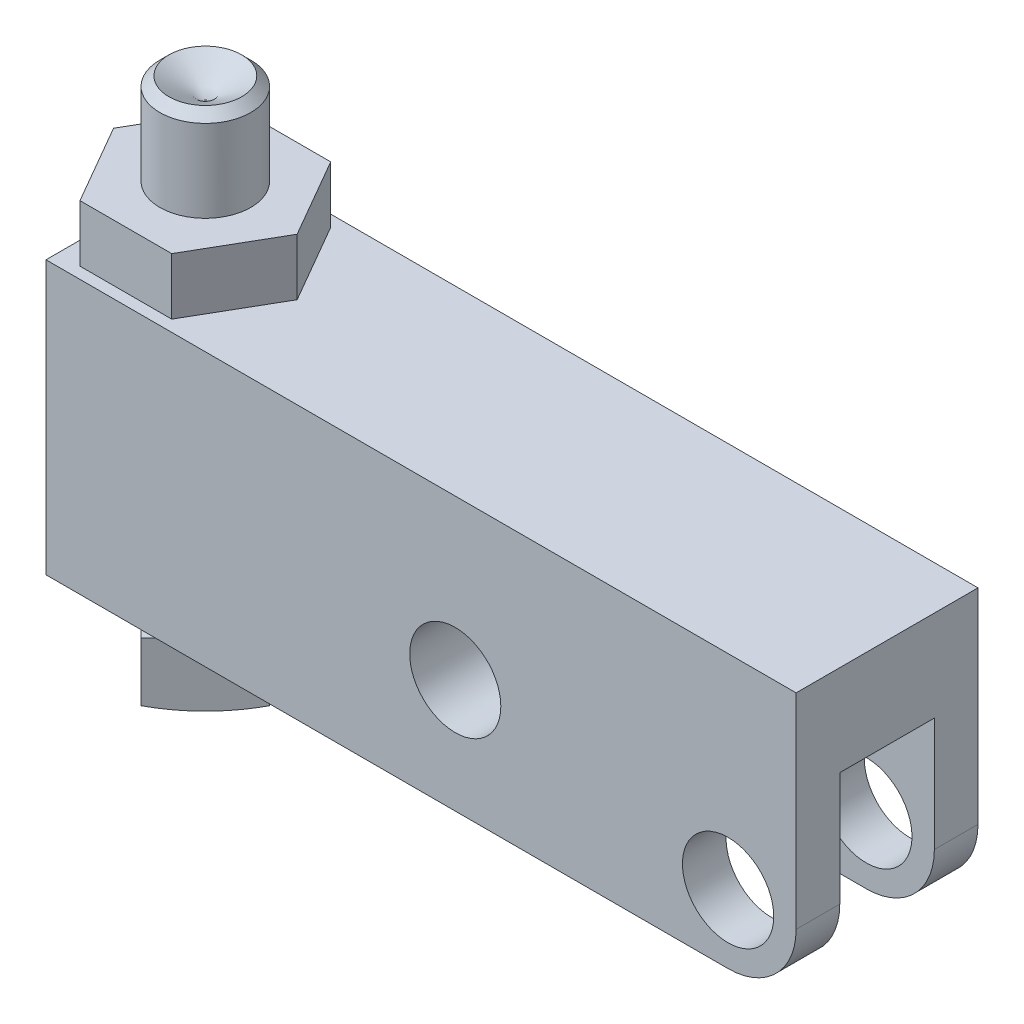
ISO-10303-21;
HEADER;
FILE_DESCRIPTION(('STEP AP214'),'2;1');
FILE_NAME('part.step','',(''),(''),'','','');
FILE_SCHEMA(('AUTOMOTIVE_DESIGN { 1 0 10303 214 1 1 1 1 }'));
ENDSEC;
DATA;
#1=APPLICATION_CONTEXT('core data for automotive mechanical design processes');
#2=APPLICATION_PROTOCOL_DEFINITION('international standard','automotive_design',2000,#1);
#3=PRODUCT_CONTEXT('',#1,'mechanical');
#4=PRODUCT('Part','Part','',(#3));
#5=PRODUCT_RELATED_PRODUCT_CATEGORY('part','',(#4));
#6=PRODUCT_DEFINITION_FORMATION('','',#4);
#7=PRODUCT_DEFINITION_CONTEXT('part definition',#1,'design');
#8=PRODUCT_DEFINITION('design','',#6,#7);
#9=PRODUCT_DEFINITION_SHAPE('','',#8);
#10=(LENGTH_UNIT() NAMED_UNIT(*) SI_UNIT(.MILLI.,.METRE.));
#11=(NAMED_UNIT(*) PLANE_ANGLE_UNIT() SI_UNIT($,.RADIAN.));
#12=(NAMED_UNIT(*) SI_UNIT($,.STERADIAN.) SOLID_ANGLE_UNIT());
#13=UNCERTAINTY_MEASURE_WITH_UNIT(LENGTH_MEASURE(1.E-05),#10,'distance_accuracy_value','');
#14=(GEOMETRIC_REPRESENTATION_CONTEXT(3) GLOBAL_UNCERTAINTY_ASSIGNED_CONTEXT((#13)) GLOBAL_UNIT_ASSIGNED_CONTEXT((#10,
#11,#12)) REPRESENTATION_CONTEXT('',''));
#15=CARTESIAN_POINT('',(0.,0.,0.));
#16=DIRECTION('',(0.,0.,1.));
#17=DIRECTION('',(1.,0.,0.));
#18=AXIS2_PLACEMENT_3D('',#15,#16,#17);
#19=CARTESIAN_POINT('',(-46.0248,-7.112,0.));
#20=DIRECTION('',(0.,1.,0.));
#21=DIRECTION('',(-1.,0.,0.));
#22=AXIS2_PLACEMENT_3D('',#19,#20,#21);
#23=PLANE('',#22);
#24=DIRECTION('',(0.707106781186547,0.,0.707106781186548));
#25=VECTOR('',#24,1.);
#26=CARTESIAN_POINT('',(-47.3399280605346,-7.112,0.));
#27=LINE('',#26,#25);
#28=CARTESIAN_POINT('',(-45.0948640302673,-7.112,2.24506403026729));
#29=VERTEX_POINT('',#28);
#30=CARTESIAN_POINT('',(-42.8498,-7.112,4.49012806053458));
#31=VERTEX_POINT('',#30);
#32=EDGE_CURVE('E198',#29,#31,#27,.T.);
#33=ORIENTED_EDGE('',*,*,#32,.T.);
#34=DIRECTION('',(0.707106781186547,0.,-0.707106781186548));
#35=VECTOR('',#34,1.);
#36=CARTESIAN_POINT('',(-42.8498,-7.112,4.49012806053458));
#37=LINE('',#36,#35);
#38=CARTESIAN_POINT('',(-40.6047359697327,-7.112,2.24506403026729));
#39=VERTEX_POINT('',#38);
#40=EDGE_CURVE('E207',#31,#39,#37,.T.);
#41=ORIENTED_EDGE('',*,*,#40,.T.);
#42=CARTESIAN_POINT('',(-42.8498,-7.112,0.));
#43=DIRECTION('',(0.,1.,0.));
#44=DIRECTION('',(-1.,0.,0.));
#45=AXIS2_PLACEMENT_3D('',#42,#43,#44);
#46=CIRCLE('',#45,3.175);
#47=EDGE_CURVE('E216',#29,#39,#46,.T.);
#48=ORIENTED_EDGE('',*,*,#47,.F.);
#49=EDGE_LOOP('',(#33,#41,#48));
#50=FACE_BOUND('',#49,.T.);
#51=ADVANCED_FACE('F37',(#50),#23,.T.);
#52=CARTESIAN_POINT('',(-40.6047359697327,-7.112,-2.24506403026729));
#53=VERTEX_POINT('',#52);
#54=EDGE_CURVE('E230',#39,#53,#46,.T.);
#55=ORIENTED_EDGE('',*,*,#54,.F.);
#56=CARTESIAN_POINT('',(-38.3596719394654,-7.112,0.));
#57=VERTEX_POINT('',#56);
#58=EDGE_CURVE('E210',#39,#57,#37,.T.);
#59=ORIENTED_EDGE('',*,*,#58,.T.);
#60=DIRECTION('',(-0.707106781186547,0.,-0.707106781186548));
#61=VECTOR('',#60,1.);
#62=CARTESIAN_POINT('',(-38.3596719394654,-7.112,0.));
#63=LINE('',#62,#61);
#64=EDGE_CURVE('E400',#57,#53,#63,.T.);
#65=ORIENTED_EDGE('',*,*,#64,.T.);
#66=EDGE_LOOP('',(#55,#59,#65));
#67=FACE_BOUND('',#66,.T.);
#68=ADVANCED_FACE('F405',(#67),#23,.T.);
#69=CARTESIAN_POINT('',(-45.0948640302673,-7.112,-2.24506403026729));
#70=VERTEX_POINT('',#69);
#71=EDGE_CURVE('E409',#53,#70,#46,.T.);
#72=ORIENTED_EDGE('',*,*,#71,.F.);
#73=CARTESIAN_POINT('',(-42.8498,-7.112,-4.49012806053457));
#74=VERTEX_POINT('',#73);
#75=EDGE_CURVE('E402',#53,#74,#63,.T.);
#76=ORIENTED_EDGE('',*,*,#75,.T.);
#77=DIRECTION('',(-0.707106781186547,0.,0.707106781186548));
#78=VECTOR('',#77,1.);
#79=CARTESIAN_POINT('',(-42.8498,-7.112,-4.49012806053457));
#80=LINE('',#79,#78);
#81=EDGE_CURVE('E217',#74,#70,#80,.T.);
#82=ORIENTED_EDGE('',*,*,#81,.T.);
#83=EDGE_LOOP('',(#72,#76,#82));
#84=FACE_BOUND('',#83,.T.);
#85=ADVANCED_FACE('F419',(#84),#23,.T.);
#86=CARTESIAN_POINT('',(-47.3399280605346,-7.112,0.));
#87=VERTEX_POINT('',#86);
#88=EDGE_CURVE('E220',#70,#87,#80,.T.);
#89=ORIENTED_EDGE('',*,*,#88,.T.);
#90=EDGE_CURVE('E52',#87,#29,#27,.T.);
#91=ORIENTED_EDGE('',*,*,#90,.T.);
#92=EDGE_CURVE('E224',#70,#29,#46,.T.);
#93=ORIENTED_EDGE('',*,*,#92,.F.);
#94=EDGE_LOOP('',(#89,#91,#93));
#95=FACE_BOUND('',#94,.T.);
#96=ADVANCED_FACE('F416',(#95),#23,.T.);
#97=CARTESIAN_POINT('',(-47.625,14.3002,6.35));
#98=DIRECTION('',(0.,-1.,0.));
#99=DIRECTION('',(0.,0.,-1.));
#100=AXIS2_PLACEMENT_3D('',#97,#98,#99);
#101=PLANE('',#100);
#102=DIRECTION('',(0.5,0.,0.866025403784439));
#103=VECTOR('',#102,1.);
#104=CARTESIAN_POINT('',(-49.258272517951,14.3002,0.));
#105=LINE('',#104,#103);
#106=CARTESIAN_POINT('',(-47.625,14.3002,2.82891098369708));
#107=VERTEX_POINT('',#106);
#108=CARTESIAN_POINT('',(-46.0540362589755,14.3002,5.5499));
#109=VERTEX_POINT('',#108);
#110=EDGE_CURVE('E270',#107,#109,#105,.T.);
#111=ORIENTED_EDGE('',*,*,#110,.F.);
#112=DIRECTION('',(0.,0.,-1.));
#113=VECTOR('',#112,1.);
#114=CARTESIAN_POINT('',(-47.625,14.3002,6.35));
#115=LINE('',#114,#113);
#116=CARTESIAN_POINT('',(-47.625,14.3002,6.35));
#117=VERTEX_POINT('',#116);
#118=EDGE_CURVE('E355',#117,#107,#115,.T.);
#119=ORIENTED_EDGE('',*,*,#118,.F.);
#120=DIRECTION('',(-1.,0.,0.));
#121=VECTOR('',#120,1.);
#122=CARTESIAN_POINT('',(-47.625,14.3002,6.35));
#123=LINE('',#122,#121);
#124=CARTESIAN_POINT('',(4.7498,14.3002,6.35));
#125=VERTEX_POINT('',#124);
#126=EDGE_CURVE('E343',#125,#117,#123,.T.);
#127=ORIENTED_EDGE('',*,*,#126,.F.);
#128=DIRECTION('',(0.,0.,-1.));
#129=VECTOR('',#128,1.);
#130=CARTESIAN_POINT('',(4.7498,14.3002,6.35));
#131=LINE('',#130,#129);
#132=CARTESIAN_POINT('',(4.7498,14.3002,-6.35));
#133=VERTEX_POINT('',#132);
#134=EDGE_CURVE('E358',#125,#133,#131,.T.);
#135=ORIENTED_EDGE('',*,*,#134,.T.);
#136=DIRECTION('',(-1.,0.,0.));
#137=VECTOR('',#136,1.);
#138=CARTESIAN_POINT('',(-47.625,14.3002,-6.35));
#139=LINE('',#138,#137);
#140=CARTESIAN_POINT('',(-47.625,14.3002,-6.35));
#141=VERTEX_POINT('',#140);
#142=EDGE_CURVE('E338',#133,#141,#139,.T.);
#143=ORIENTED_EDGE('',*,*,#142,.T.);
#144=CARTESIAN_POINT('',(-47.625,14.3002,-2.82891098369709));
#145=VERTEX_POINT('',#144);
#146=EDGE_CURVE('E345',#145,#141,#115,.T.);
#147=ORIENTED_EDGE('',*,*,#146,.F.);
#148=DIRECTION('',(-0.5,0.,0.866025403784439));
#149=VECTOR('',#148,1.);
#150=CARTESIAN_POINT('',(-46.0540362589755,14.3002,-5.5499));
#151=LINE('',#150,#149);
#152=CARTESIAN_POINT('',(-46.0540362589755,14.3002,-5.5499));
#153=VERTEX_POINT('',#152);
#154=EDGE_CURVE('E264',#153,#145,#151,.T.);
#155=ORIENTED_EDGE('',*,*,#154,.F.);
#156=DIRECTION('',(-1.,0.,0.));
#157=VECTOR('',#156,1.);
#158=CARTESIAN_POINT('',(-39.6455637410245,14.3002,-5.5499));
#159=LINE('',#158,#157);
#160=CARTESIAN_POINT('',(-39.6455637410245,14.3002,-5.5499));
#161=VERTEX_POINT('',#160);
#162=EDGE_CURVE('E260',#161,#153,#159,.T.);
#163=ORIENTED_EDGE('',*,*,#162,.F.);
#164=DIRECTION('',(-0.5,0.,-0.866025403784439));
#165=VECTOR('',#164,1.);
#166=CARTESIAN_POINT('',(-36.441327482049,14.3002,0.));
#167=LINE('',#166,#165);
#168=CARTESIAN_POINT('',(-36.441327482049,14.3002,0.));
#169=VERTEX_POINT('',#168);
#170=EDGE_CURVE('E257',#169,#161,#167,.T.);
#171=ORIENTED_EDGE('',*,*,#170,.F.);
#172=DIRECTION('',(0.5,0.,-0.866025403784438));
#173=VECTOR('',#172,1.);
#174=CARTESIAN_POINT('',(-39.6455637410245,14.3002,5.5499));
#175=LINE('',#174,#173);
#176=CARTESIAN_POINT('',(-39.6455637410245,14.3002,5.5499));
#177=VERTEX_POINT('',#176);
#178=EDGE_CURVE('E239',#177,#169,#175,.T.);
#179=ORIENTED_EDGE('',*,*,#178,.F.);
#180=DIRECTION('',(1.,0.,0.));
#181=VECTOR('',#180,1.);
#182=CARTESIAN_POINT('',(-46.0540362589755,14.3002,5.5499));
#183=LINE('',#182,#181);
#184=EDGE_CURVE('E244',#109,#177,#183,.T.);
#185=ORIENTED_EDGE('',*,*,#184,.F.);
#186=EDGE_LOOP('',(#111,#119,#127,#135,#143,#147,#155,#163,#171,#179,#185));
#187=FACE_BOUND('',#186,.T.);
#188=ADVANCED_FACE('F426',(#187),#101,.F.);
#189=CARTESIAN_POINT('',(0.,0.,6.35));
#190=DIRECTION('',(0.,0.,-1.));
#191=DIRECTION('',(-1.,0.,0.));
#192=AXIS2_PLACEMENT_3D('',#189,#190,#191);
#193=CYLINDRICAL_SURFACE('',#192,3.1877);
#194=CARTESIAN_POINT('',(0.,0.,3.302));
#195=DIRECTION('',(0.,0.,1.));
#196=DIRECTION('',(1.,0.,0.));
#197=AXIS2_PLACEMENT_3D('',#194,#195,#196);
#198=CIRCLE('',#197,3.1877);
#199=CARTESIAN_POINT('',(3.1877,0.,3.302));
#200=VERTEX_POINT('',#199);
#201=EDGE_CURVE('E327',#200,#200,#198,.T.);
#202=ORIENTED_EDGE('',*,*,#201,.F.);
#203=EDGE_LOOP('',(#202));
#204=FACE_BOUND('',#203,.T.);
#205=CARTESIAN_POINT('',(0.,0.,6.35));
#206=DIRECTION('',(0.,0.,1.));
#207=DIRECTION('',(1.,0.,0.));
#208=AXIS2_PLACEMENT_3D('',#205,#206,#207);
#209=CIRCLE('',#208,3.1877);
#210=CARTESIAN_POINT('',(3.1877,0.,6.35));
#211=VERTEX_POINT('',#210);
#212=EDGE_CURVE('E328',#211,#211,#209,.T.);
#213=ORIENTED_EDGE('',*,*,#212,.T.);
#214=EDGE_LOOP('',(#213));
#215=FACE_BOUND('',#214,.T.);
#216=ADVANCED_FACE('F451',(#204,#215),#193,.F.);
#217=CARTESIAN_POINT('',(-47.625,-4.7498,6.35));
#218=DIRECTION('',(0.,0.,1.));
#219=DIRECTION('',(1.,0.,0.));
#220=AXIS2_PLACEMENT_3D('',#217,#218,#219);
#221=PLANE('',#220);
#222=ORIENTED_EDGE('',*,*,#212,.F.);
#223=EDGE_LOOP('',(#222));
#224=FACE_BOUND('',#223,.T.);
#225=DIRECTION('',(1.,0.,0.));
#226=VECTOR('',#225,1.);
#227=CARTESIAN_POINT('',(-47.625,-4.7498,6.35));
#228=LINE('',#227,#226);
#229=CARTESIAN_POINT('',(-47.625,-4.7498,6.35));
#230=VERTEX_POINT('',#229);
#231=CARTESIAN_POINT('',(0.,-4.7498,6.35));
#232=VERTEX_POINT('',#231);
#233=EDGE_CURVE('E337',#230,#232,#228,.T.);
#234=ORIENTED_EDGE('',*,*,#233,.T.);
#235=CARTESIAN_POINT('',(0.,0.,6.35));
#236=DIRECTION('',(0.,0.,1.));
#237=DIRECTION('',(1.,0.,0.));
#238=AXIS2_PLACEMENT_3D('',#235,#236,#237);
#239=CIRCLE('',#238,4.7498);
#240=CARTESIAN_POINT('',(4.7498,0.,6.35));
#241=VERTEX_POINT('',#240);
#242=EDGE_CURVE('E385',#232,#241,#239,.T.);
#243=ORIENTED_EDGE('',*,*,#242,.T.);
#244=DIRECTION('',(0.,1.,0.));
#245=VECTOR('',#244,1.);
#246=CARTESIAN_POINT('',(4.7498,14.3002,6.35));
#247=LINE('',#246,#245);
#248=EDGE_CURVE('E341',#241,#125,#247,.T.);
#249=ORIENTED_EDGE('',*,*,#248,.T.);
#250=ORIENTED_EDGE('',*,*,#126,.T.);
#251=DIRECTION('',(0.,-1.,0.));
#252=VECTOR('',#251,1.);
#253=CARTESIAN_POINT('',(-47.625,14.3002,6.35));
#254=LINE('',#253,#252);
#255=EDGE_CURVE('E334',#117,#230,#254,.T.);
#256=ORIENTED_EDGE('',*,*,#255,.T.);
#257=EDGE_LOOP('',(#234,#243,#249,#250,#256));
#258=FACE_BOUND('',#257,.T.);
#259=CARTESIAN_POINT('',(-19.05,3.175,6.35));
#260=DIRECTION('',(0.,0.,1.));
#261=DIRECTION('',(1.,0.,0.));
#262=AXIS2_PLACEMENT_3D('',#259,#260,#261);
#263=CIRCLE('',#262,3.18135);
#264=CARTESIAN_POINT('',(-15.86865,3.175,6.35));
#265=VERTEX_POINT('',#264);
#266=EDGE_CURVE('E320',#265,#265,#263,.T.);
#267=ORIENTED_EDGE('',*,*,#266,.F.);
#268=EDGE_LOOP('',(#267));
#269=FACE_BOUND('',#268,.T.);
#270=ADVANCED_FACE('F462',(#224,#258,#269),#221,.T.);
#271=CARTESIAN_POINT('',(-47.625,-4.7498,-6.35));
#272=DIRECTION('',(0.,0.,1.));
#273=DIRECTION('',(1.,0.,0.));
#274=AXIS2_PLACEMENT_3D('',#271,#272,#273);
#275=PLANE('',#274);
#276=CARTESIAN_POINT('',(0.,0.,-6.35));
#277=DIRECTION('',(0.,0.,1.));
#278=DIRECTION('',(1.,0.,0.));
#279=AXIS2_PLACEMENT_3D('',#276,#277,#278);
#280=CIRCLE('',#279,3.1877);
#281=CARTESIAN_POINT('',(3.1877,0.,-6.35));
#282=VERTEX_POINT('',#281);
#283=EDGE_CURVE('E323',#282,#282,#280,.T.);
#284=ORIENTED_EDGE('',*,*,#283,.T.);
#285=EDGE_LOOP('',(#284));
#286=FACE_BOUND('',#285,.T.);
#287=DIRECTION('',(0.,1.,0.));
#288=VECTOR('',#287,1.);
#289=CARTESIAN_POINT('',(4.7498,14.3002,-6.35));
#290=LINE('',#289,#288);
#291=CARTESIAN_POINT('',(4.7498,0.,-6.35));
#292=VERTEX_POINT('',#291);
#293=EDGE_CURVE('E351',#292,#133,#290,.T.);
#294=ORIENTED_EDGE('',*,*,#293,.F.);
#295=CARTESIAN_POINT('',(0.,0.,-6.35));
#296=DIRECTION('',(0.,0.,1.));
#297=DIRECTION('',(1.,0.,0.));
#298=AXIS2_PLACEMENT_3D('',#295,#296,#297);
#299=CIRCLE('',#298,4.7498);
#300=CARTESIAN_POINT('',(0.,-4.7498,-6.35));
#301=VERTEX_POINT('',#300);
#302=EDGE_CURVE('E375',#292,#301,#299,.F.);
#303=ORIENTED_EDGE('',*,*,#302,.T.);
#304=DIRECTION('',(1.,0.,0.));
#305=VECTOR('',#304,1.);
#306=CARTESIAN_POINT('',(-47.625,-4.7498,-6.35));
#307=LINE('',#306,#305);
#308=CARTESIAN_POINT('',(-47.625,-4.7498,-6.35));
#309=VERTEX_POINT('',#308);
#310=EDGE_CURVE('E348',#309,#301,#307,.T.);
#311=ORIENTED_EDGE('',*,*,#310,.F.);
#312=DIRECTION('',(0.,-1.,0.));
#313=VECTOR('',#312,1.);
#314=CARTESIAN_POINT('',(-47.625,14.3002,-6.35));
#315=LINE('',#314,#313);
#316=EDGE_CURVE('E331',#141,#309,#315,.T.);
#317=ORIENTED_EDGE('',*,*,#316,.F.);
#318=ORIENTED_EDGE('',*,*,#142,.F.);
#319=EDGE_LOOP('',(#294,#303,#311,#317,#318));
#320=FACE_BOUND('',#319,.T.);
#321=CARTESIAN_POINT('',(-19.05,3.175,-6.35));
#322=DIRECTION('',(0.,0.,1.));
#323=DIRECTION('',(1.,0.,0.));
#324=AXIS2_PLACEMENT_3D('',#321,#322,#323);
#325=CIRCLE('',#324,3.18135);
#326=CARTESIAN_POINT('',(-15.86865,3.175,-6.35));
#327=VERTEX_POINT('',#326);
#328=EDGE_CURVE('E324',#327,#327,#325,.T.);
#329=ORIENTED_EDGE('',*,*,#328,.T.);
#330=EDGE_LOOP('',(#329));
#331=FACE_BOUND('',#330,.T.);
#332=ADVANCED_FACE('F474',(#286,#320,#331),#275,.F.);
#333=CARTESIAN_POINT('',(-47.625,14.3002,6.35));
#334=DIRECTION('',(1.,0.,0.));
#335=DIRECTION('',(0.,1.,0.));
#336=AXIS2_PLACEMENT_3D('',#333,#334,#335);
#337=PLANE('',#336);
#338=ORIENTED_EDGE('',*,*,#316,.T.);
#339=DIRECTION('',(0.,0.,-1.));
#340=VECTOR('',#339,1.);
#341=CARTESIAN_POINT('',(-47.625,-4.7498,6.35));
#342=LINE('',#341,#340);
#343=EDGE_CURVE('E362',#230,#309,#342,.T.);
#344=ORIENTED_EDGE('',*,*,#343,.F.);
#345=ORIENTED_EDGE('',*,*,#255,.F.);
#346=ORIENTED_EDGE('',*,*,#118,.T.);
#347=EDGE_CURVE('E359',#107,#145,#115,.T.);
#348=ORIENTED_EDGE('',*,*,#347,.T.);
#349=ORIENTED_EDGE('',*,*,#146,.T.);
#350=EDGE_LOOP('',(#338,#344,#345,#346,#348,#349));
#351=FACE_BOUND('',#350,.T.);
#352=ADVANCED_FACE('F484',(#351),#337,.F.);
#353=CARTESIAN_POINT('',(-47.625,-4.7498,6.35));
#354=DIRECTION('',(0.,1.,0.));
#355=DIRECTION('',(0.,0.,1.));
#356=AXIS2_PLACEMENT_3D('',#353,#354,#355);
#357=PLANE('',#356);
#358=CARTESIAN_POINT('',(-42.8498,-4.7498,0.));
#359=DIRECTION('',(0.,1.,0.));
#360=DIRECTION('',(0.,0.,1.));
#361=AXIS2_PLACEMENT_3D('',#358,#359,#360);
#362=CIRCLE('',#361,3.175);
#363=CARTESIAN_POINT('',(-42.8498,-4.7498,3.175));
#364=VERTEX_POINT('',#363);
#365=EDGE_CURVE('E236',#364,#364,#362,.T.);
#366=ORIENTED_EDGE('',*,*,#365,.T.);
#367=EDGE_LOOP('',(#366));
#368=FACE_BOUND('',#367,.T.);
#369=ORIENTED_EDGE('',*,*,#310,.T.);
#370=DIRECTION('',(0.,0.,-1.));
#371=VECTOR('',#370,1.);
#372=CARTESIAN_POINT('',(0.,-4.7498,6.35));
#373=LINE('',#372,#371);
#374=CARTESIAN_POINT('',(0.,-4.7498,-3.302));
#375=VERTEX_POINT('',#374);
#376=EDGE_CURVE('E379',#301,#375,#373,.F.);
#377=ORIENTED_EDGE('',*,*,#376,.T.);
#378=DIRECTION('',(1.,0.,0.));
#379=VECTOR('',#378,1.);
#380=CARTESIAN_POINT('',(-7.9502,-4.7498,-3.302));
#381=LINE('',#380,#379);
#382=CARTESIAN_POINT('',(-7.9502,-4.7498,-3.302));
#383=VERTEX_POINT('',#382);
#384=EDGE_CURVE('E305',#383,#375,#381,.T.);
#385=ORIENTED_EDGE('',*,*,#384,.F.);
#386=CARTESIAN_POINT('',(-7.9502,-4.7498,0.));
#387=DIRECTION('',(0.,-1.,0.));
#388=DIRECTION('',(0.,0.,-1.));
#389=AXIS2_PLACEMENT_3D('',#386,#387,#388);
#390=CIRCLE('',#389,3.302);
#391=CARTESIAN_POINT('',(-7.9502,-4.7498,3.302));
#392=VERTEX_POINT('',#391);
#393=EDGE_CURVE('E290',#392,#383,#390,.T.);
#394=ORIENTED_EDGE('',*,*,#393,.F.);
#395=DIRECTION('',(-1.,0.,0.));
#396=VECTOR('',#395,1.);
#397=CARTESIAN_POINT('',(-7.9502,-4.7498,3.302));
#398=LINE('',#397,#396);
#399=CARTESIAN_POINT('',(0.,-4.7498,3.302));
#400=VERTEX_POINT('',#399);
#401=EDGE_CURVE('E295',#400,#392,#398,.T.);
#402=ORIENTED_EDGE('',*,*,#401,.F.);
#403=DIRECTION('',(0.,0.,-1.));
#404=VECTOR('',#403,1.);
#405=CARTESIAN_POINT('',(0.,-4.7498,6.35));
#406=LINE('',#405,#404);
#407=EDGE_CURVE('E377',#400,#232,#406,.F.);
#408=ORIENTED_EDGE('',*,*,#407,.T.);
#409=ORIENTED_EDGE('',*,*,#233,.F.);
#410=ORIENTED_EDGE('',*,*,#343,.T.);
#411=EDGE_LOOP('',(#369,#377,#385,#394,#402,#408,#409,#410));
#412=FACE_BOUND('',#411,.T.);
#413=ADVANCED_FACE('F493',(#368,#412),#357,.F.);
#414=CARTESIAN_POINT('',(4.7498,14.3002,6.35));
#415=DIRECTION('',(-1.,0.,0.));
#416=DIRECTION('',(0.,0.,1.));
#417=AXIS2_PLACEMENT_3D('',#414,#415,#416);
#418=PLANE('',#417);
#419=DIRECTION('',(0.,-1.,0.));
#420=VECTOR('',#419,1.);
#421=CARTESIAN_POINT('',(4.7498,7.9502,-3.302));
#422=LINE('',#421,#420);
#423=CARTESIAN_POINT('',(4.7498,7.9502,-3.302));
#424=VERTEX_POINT('',#423);
#425=CARTESIAN_POINT('',(4.7498,0.,-3.302));
#426=VERTEX_POINT('',#425);
#427=EDGE_CURVE('E316',#424,#426,#422,.T.);
#428=ORIENTED_EDGE('',*,*,#427,.T.);
#429=DIRECTION('',(0.,0.,-1.));
#430=VECTOR('',#429,1.);
#431=CARTESIAN_POINT('',(4.7498,0.,6.35));
#432=LINE('',#431,#430);
#433=EDGE_CURVE('E372',#426,#292,#432,.T.);
#434=ORIENTED_EDGE('',*,*,#433,.T.);
#435=ORIENTED_EDGE('',*,*,#293,.T.);
#436=ORIENTED_EDGE('',*,*,#134,.F.);
#437=ORIENTED_EDGE('',*,*,#248,.F.);
#438=DIRECTION('',(0.,0.,-1.));
#439=VECTOR('',#438,1.);
#440=CARTESIAN_POINT('',(4.7498,0.,6.35));
#441=LINE('',#440,#439);
#442=CARTESIAN_POINT('',(4.7498,0.,3.302));
#443=VERTEX_POINT('',#442);
#444=EDGE_CURVE('E365',#241,#443,#441,.T.);
#445=ORIENTED_EDGE('',*,*,#444,.T.);
#446=DIRECTION('',(0.,-1.,0.));
#447=VECTOR('',#446,1.);
#448=CARTESIAN_POINT('',(4.7498,7.9502,3.302));
#449=LINE('',#448,#447);
#450=CARTESIAN_POINT('',(4.7498,7.9502,3.302));
#451=VERTEX_POINT('',#450);
#452=EDGE_CURVE('E313',#451,#443,#449,.T.);
#453=ORIENTED_EDGE('',*,*,#452,.F.);
#454=DIRECTION('',(0.,0.,1.));
#455=VECTOR('',#454,1.);
#456=CARTESIAN_POINT('',(4.7498,7.9502,3.302));
#457=LINE('',#456,#455);
#458=EDGE_CURVE('E297',#424,#451,#457,.T.);
#459=ORIENTED_EDGE('',*,*,#458,.F.);
#460=EDGE_LOOP('',(#428,#434,#435,#436,#437,#445,#453,#459));
#461=FACE_BOUND('',#460,.T.);
#462=ADVANCED_FACE('F503',(#461),#418,.F.);
#463=CARTESIAN_POINT('',(0.,0.,-3.302));
#464=DIRECTION('',(0.,0.,-1.));
#465=DIRECTION('',(-1.,0.,0.));
#466=AXIS2_PLACEMENT_3D('',#463,#464,#465);
#467=CIRCLE('',#466,3.1877);
#468=CARTESIAN_POINT('',(-3.1877,0.,-3.302));
#469=VERTEX_POINT('',#468);
#470=EDGE_CURVE('E312',#469,#469,#467,.T.);
#471=ORIENTED_EDGE('',*,*,#470,.F.);
#472=EDGE_LOOP('',(#471));
#473=FACE_BOUND('',#472,.T.);
#474=ORIENTED_EDGE('',*,*,#283,.F.);
#475=EDGE_LOOP('',(#474));
#476=FACE_BOUND('',#475,.T.);
#477=ADVANCED_FACE('F465',(#473,#476),#193,.F.);
#478=CARTESIAN_POINT('',(-19.05,3.175,6.35));
#479=DIRECTION('',(0.,0.,-1.));
#480=DIRECTION('',(-1.,0.,0.));
#481=AXIS2_PLACEMENT_3D('',#478,#479,#480);
#482=CYLINDRICAL_SURFACE('',#481,3.18135);
#483=ORIENTED_EDGE('',*,*,#266,.T.);
#484=EDGE_LOOP('',(#483));
#485=FACE_BOUND('',#484,.T.);
#486=ORIENTED_EDGE('',*,*,#328,.F.);
#487=EDGE_LOOP('',(#486));
#488=FACE_BOUND('',#487,.T.);
#489=ADVANCED_FACE('F521',(#485,#488),#482,.F.);
#490=CARTESIAN_POINT('',(-7.9502,7.9502,0.));
#491=DIRECTION('',(0.,-1.,0.));
#492=DIRECTION('',(0.,0.,-1.));
#493=AXIS2_PLACEMENT_3D('',#490,#491,#492);
#494=CYLINDRICAL_SURFACE('',#493,3.302);
#495=ORIENTED_EDGE('',*,*,#393,.T.);
#496=DIRECTION('',(0.,-1.,0.));
#497=VECTOR('',#496,1.);
#498=CARTESIAN_POINT('',(-7.9502,7.9502,-3.302));
#499=LINE('',#498,#497);
#500=CARTESIAN_POINT('',(-7.9502,7.9502,-3.302));
#501=VERTEX_POINT('',#500);
#502=EDGE_CURVE('E302',#501,#383,#499,.T.);
#503=ORIENTED_EDGE('',*,*,#502,.F.);
#504=CARTESIAN_POINT('',(-7.9502,7.9502,0.));
#505=DIRECTION('',(0.,-1.,0.));
#506=DIRECTION('',(0.,0.,-1.));
#507=AXIS2_PLACEMENT_3D('',#504,#505,#506);
#508=CIRCLE('',#507,3.302);
#509=CARTESIAN_POINT('',(-7.9502,7.9502,3.302));
#510=VERTEX_POINT('',#509);
#511=EDGE_CURVE('E291',#510,#501,#508,.T.);
#512=ORIENTED_EDGE('',*,*,#511,.F.);
#513=DIRECTION('',(0.,-1.,0.));
#514=VECTOR('',#513,1.);
#515=CARTESIAN_POINT('',(-7.9502,7.9502,3.302));
#516=LINE('',#515,#514);
#517=EDGE_CURVE('E309',#510,#392,#516,.T.);
#518=ORIENTED_EDGE('',*,*,#517,.T.);
#519=EDGE_LOOP('',(#495,#503,#512,#518));
#520=FACE_BOUND('',#519,.T.);
#521=ADVANCED_FACE('F529',(#520),#494,.F.);
#522=CARTESIAN_POINT('',(-7.9502,7.9502,3.302));
#523=DIRECTION('',(0.,0.,1.));
#524=DIRECTION('',(1.,0.,0.));
#525=AXIS2_PLACEMENT_3D('',#522,#523,#524);
#526=PLANE('',#525);
#527=ORIENTED_EDGE('',*,*,#201,.T.);
#528=EDGE_LOOP('',(#527));
#529=FACE_BOUND('',#528,.T.);
#530=ORIENTED_EDGE('',*,*,#452,.T.);
#531=CARTESIAN_POINT('',(0.,0.,3.302));
#532=DIRECTION('',(0.,0.,1.));
#533=DIRECTION('',(1.,0.,0.));
#534=AXIS2_PLACEMENT_3D('',#531,#532,#533);
#535=CIRCLE('',#534,4.7498);
#536=EDGE_CURVE('E383',#443,#400,#535,.F.);
#537=ORIENTED_EDGE('',*,*,#536,.T.);
#538=ORIENTED_EDGE('',*,*,#401,.T.);
#539=ORIENTED_EDGE('',*,*,#517,.F.);
#540=DIRECTION('',(-1.,0.,0.));
#541=VECTOR('',#540,1.);
#542=CARTESIAN_POINT('',(-7.9502,7.9502,3.302));
#543=LINE('',#542,#541);
#544=EDGE_CURVE('E299',#451,#510,#543,.T.);
#545=ORIENTED_EDGE('',*,*,#544,.F.);
#546=EDGE_LOOP('',(#530,#537,#538,#539,#545));
#547=FACE_BOUND('',#546,.T.);
#548=ADVANCED_FACE('F537',(#529,#547),#526,.F.);
#549=CARTESIAN_POINT('',(-7.9502,7.9502,-3.302));
#550=DIRECTION('',(0.,0.,-1.));
#551=DIRECTION('',(-1.,0.,0.));
#552=AXIS2_PLACEMENT_3D('',#549,#550,#551);
#553=PLANE('',#552);
#554=ORIENTED_EDGE('',*,*,#470,.T.);
#555=EDGE_LOOP('',(#554));
#556=FACE_BOUND('',#555,.T.);
#557=ORIENTED_EDGE('',*,*,#384,.T.);
#558=CARTESIAN_POINT('',(0.,0.,-3.302));
#559=DIRECTION('',(0.,0.,-1.));
#560=DIRECTION('',(-1.,0.,0.));
#561=AXIS2_PLACEMENT_3D('',#558,#559,#560);
#562=CIRCLE('',#561,4.7498);
#563=EDGE_CURVE('E381',#375,#426,#562,.F.);
#564=ORIENTED_EDGE('',*,*,#563,.T.);
#565=ORIENTED_EDGE('',*,*,#427,.F.);
#566=DIRECTION('',(1.,0.,0.));
#567=VECTOR('',#566,1.);
#568=CARTESIAN_POINT('',(-7.9502,7.9502,-3.302));
#569=LINE('',#568,#567);
#570=EDGE_CURVE('E294',#501,#424,#569,.T.);
#571=ORIENTED_EDGE('',*,*,#570,.F.);
#572=ORIENTED_EDGE('',*,*,#502,.T.);
#573=EDGE_LOOP('',(#557,#564,#565,#571,#572));
#574=FACE_BOUND('',#573,.T.);
#575=ADVANCED_FACE('F545',(#556,#574),#553,.F.);
#576=CARTESIAN_POINT('',(-7.9502,7.9502,0.));
#577=DIRECTION('',(0.,-1.,0.));
#578=DIRECTION('',(0.,0.,-1.));
#579=AXIS2_PLACEMENT_3D('',#576,#577,#578);
#580=PLANE('',#579);
#581=ORIENTED_EDGE('',*,*,#511,.T.);
#582=ORIENTED_EDGE('',*,*,#570,.T.);
#583=ORIENTED_EDGE('',*,*,#458,.T.);
#584=ORIENTED_EDGE('',*,*,#544,.T.);
#585=EDGE_LOOP('',(#581,#582,#583,#584));
#586=FACE_BOUND('',#585,.T.);
#587=ADVANCED_FACE('F554',(#586),#580,.T.);
#588=CARTESIAN_POINT('',(0.,0.,6.35));
#589=DIRECTION('',(0.,0.,-1.));
#590=DIRECTION('',(-1.,0.,0.));
#591=AXIS2_PLACEMENT_3D('',#588,#589,#590);
#592=CYLINDRICAL_SURFACE('',#591,4.7498);
#593=ORIENTED_EDGE('',*,*,#563,.F.);
#594=ORIENTED_EDGE('',*,*,#376,.F.);
#595=ORIENTED_EDGE('',*,*,#302,.F.);
#596=ORIENTED_EDGE('',*,*,#433,.F.);
#597=EDGE_LOOP('',(#593,#594,#595,#596));
#598=FACE_BOUND('',#597,.T.);
#599=ADVANCED_FACE('F563',(#598),#592,.T.);
#600=CARTESIAN_POINT('',(0.,0.,6.35));
#601=DIRECTION('',(0.,0.,-1.));
#602=DIRECTION('',(-1.,0.,0.));
#603=AXIS2_PLACEMENT_3D('',#600,#601,#602);
#604=CYLINDRICAL_SURFACE('',#603,4.7498);
#605=ORIENTED_EDGE('',*,*,#242,.F.);
#606=ORIENTED_EDGE('',*,*,#407,.F.);
#607=ORIENTED_EDGE('',*,*,#536,.F.);
#608=ORIENTED_EDGE('',*,*,#444,.F.);
#609=EDGE_LOOP('',(#605,#606,#607,#608));
#610=FACE_BOUND('',#609,.T.);
#611=ADVANCED_FACE('F39',(#610),#604,.T.);
#612=CARTESIAN_POINT('',(-39.6455637410245,18.2626,5.5499));
#613=DIRECTION('',(-0.866025403784438,0.,-0.5));
#614=DIRECTION('',(-0.5,0.,0.866025403784439));
#615=AXIS2_PLACEMENT_3D('',#612,#613,#614);
#616=PLANE('',#615);
#617=ORIENTED_EDGE('',*,*,#178,.T.);
#618=DIRECTION('',(0.,-1.,0.));
#619=VECTOR('',#618,1.);
#620=CARTESIAN_POINT('',(-36.441327482049,18.2626,0.));
#621=LINE('',#620,#619);
#622=CARTESIAN_POINT('',(-36.441327482049,18.2626,0.));
#623=VERTEX_POINT('',#622);
#624=EDGE_CURVE('E287',#623,#169,#621,.T.);
#625=ORIENTED_EDGE('',*,*,#624,.F.);
#626=DIRECTION('',(0.5,0.,-0.866025403784438));
#627=VECTOR('',#626,1.);
#628=CARTESIAN_POINT('',(-39.6455637410245,18.2626,5.5499));
#629=LINE('',#628,#627);
#630=CARTESIAN_POINT('',(-39.6455637410245,18.2626,5.5499));
#631=VERTEX_POINT('',#630);
#632=EDGE_CURVE('E240',#631,#623,#629,.T.);
#633=ORIENTED_EDGE('',*,*,#632,.F.);
#634=DIRECTION('',(0.,-1.,0.));
#635=VECTOR('',#634,1.);
#636=CARTESIAN_POINT('',(-39.6455637410245,18.2626,5.5499));
#637=LINE('',#636,#635);
#638=EDGE_CURVE('E254',#631,#177,#637,.T.);
#639=ORIENTED_EDGE('',*,*,#638,.T.);
#640=EDGE_LOOP('',(#617,#625,#633,#639));
#641=FACE_BOUND('',#640,.T.);
#642=ADVANCED_FACE('F577',(#641),#616,.F.);
#643=CARTESIAN_POINT('',(-36.441327482049,18.2626,0.));
#644=DIRECTION('',(-0.866025403784439,0.,0.5));
#645=DIRECTION('',(0.5,0.,0.866025403784439));
#646=AXIS2_PLACEMENT_3D('',#643,#644,#645);
#647=PLANE('',#646);
#648=ORIENTED_EDGE('',*,*,#170,.T.);
#649=DIRECTION('',(0.,-1.,0.));
#650=VECTOR('',#649,1.);
#651=CARTESIAN_POINT('',(-39.6455637410245,18.2626,-5.5499));
#652=LINE('',#651,#650);
#653=CARTESIAN_POINT('',(-39.6455637410245,18.2626,-5.5499));
#654=VERTEX_POINT('',#653);
#655=EDGE_CURVE('E284',#654,#161,#652,.T.);
#656=ORIENTED_EDGE('',*,*,#655,.F.);
#657=DIRECTION('',(-0.5,0.,-0.866025403784439));
#658=VECTOR('',#657,1.);
#659=CARTESIAN_POINT('',(-36.441327482049,18.2626,0.));
#660=LINE('',#659,#658);
#661=EDGE_CURVE('E243',#623,#654,#660,.T.);
#662=ORIENTED_EDGE('',*,*,#661,.F.);
#663=ORIENTED_EDGE('',*,*,#624,.T.);
#664=EDGE_LOOP('',(#648,#656,#662,#663));
#665=FACE_BOUND('',#664,.T.);
#666=ADVANCED_FACE('F585',(#665),#647,.F.);
#667=CARTESIAN_POINT('',(-39.6455637410245,18.2626,-5.5499));
#668=DIRECTION('',(0.,0.,1.));
#669=DIRECTION('',(1.,0.,0.));
#670=AXIS2_PLACEMENT_3D('',#667,#668,#669);
#671=PLANE('',#670);
#672=ORIENTED_EDGE('',*,*,#162,.T.);
#673=DIRECTION('',(0.,-1.,0.));
#674=VECTOR('',#673,1.);
#675=CARTESIAN_POINT('',(-46.0540362589755,18.2626,-5.5499));
#676=LINE('',#675,#674);
#677=CARTESIAN_POINT('',(-46.0540362589755,18.2626,-5.5499));
#678=VERTEX_POINT('',#677);
#679=EDGE_CURVE('E281',#678,#153,#676,.T.);
#680=ORIENTED_EDGE('',*,*,#679,.F.);
#681=DIRECTION('',(-1.,0.,0.));
#682=VECTOR('',#681,1.);
#683=CARTESIAN_POINT('',(-39.6455637410245,18.2626,-5.5499));
#684=LINE('',#683,#682);
#685=EDGE_CURVE('E246',#654,#678,#684,.T.);
#686=ORIENTED_EDGE('',*,*,#685,.F.);
#687=ORIENTED_EDGE('',*,*,#655,.T.);
#688=EDGE_LOOP('',(#672,#680,#686,#687));
#689=FACE_BOUND('',#688,.T.);
#690=ADVANCED_FACE('F595',(#689),#671,.F.);
#691=CARTESIAN_POINT('',(-46.0540362589755,18.2626,-5.5499));
#692=DIRECTION('',(0.866025403784439,0.,0.5));
#693=DIRECTION('',(0.5,0.,-0.866025403784439));
#694=AXIS2_PLACEMENT_3D('',#691,#692,#693);
#695=PLANE('',#694);
#696=ORIENTED_EDGE('',*,*,#154,.T.);
#697=CARTESIAN_POINT('',(-49.258272517951,14.3002,0.));
#698=VERTEX_POINT('',#697);
#699=EDGE_CURVE('E263',#145,#698,#151,.T.);
#700=ORIENTED_EDGE('',*,*,#699,.T.);
#701=DIRECTION('',(0.,-1.,0.));
#702=VECTOR('',#701,1.);
#703=CARTESIAN_POINT('',(-49.258272517951,18.2626,0.));
#704=LINE('',#703,#702);
#705=CARTESIAN_POINT('',(-49.258272517951,18.2626,0.));
#706=VERTEX_POINT('',#705);
#707=EDGE_CURVE('E278',#706,#698,#704,.T.);
#708=ORIENTED_EDGE('',*,*,#707,.F.);
#709=DIRECTION('',(-0.5,0.,0.866025403784439));
#710=VECTOR('',#709,1.);
#711=CARTESIAN_POINT('',(-46.0540362589755,18.2626,-5.5499));
#712=LINE('',#711,#710);
#713=EDGE_CURVE('E248',#678,#706,#712,.T.);
#714=ORIENTED_EDGE('',*,*,#713,.F.);
#715=ORIENTED_EDGE('',*,*,#679,.T.);
#716=EDGE_LOOP('',(#696,#700,#708,#714,#715));
#717=FACE_BOUND('',#716,.T.);
#718=ADVANCED_FACE('F604',(#717),#695,.F.);
#719=CARTESIAN_POINT('',(-49.258272517951,18.2626,0.));
#720=DIRECTION('',(0.866025403784439,0.,-0.5));
#721=DIRECTION('',(-0.5,0.,-0.866025403784439));
#722=AXIS2_PLACEMENT_3D('',#719,#720,#721);
#723=PLANE('',#722);
#724=EDGE_CURVE('E267',#698,#107,#105,.T.);
#725=ORIENTED_EDGE('',*,*,#724,.T.);
#726=ORIENTED_EDGE('',*,*,#110,.T.);
#727=DIRECTION('',(0.,-1.,0.));
#728=VECTOR('',#727,1.);
#729=CARTESIAN_POINT('',(-46.0540362589755,18.2626,5.5499));
#730=LINE('',#729,#728);
#731=CARTESIAN_POINT('',(-46.0540362589755,18.2626,5.5499));
#732=VERTEX_POINT('',#731);
#733=EDGE_CURVE('E275',#732,#109,#730,.T.);
#734=ORIENTED_EDGE('',*,*,#733,.F.);
#735=DIRECTION('',(0.5,0.,0.866025403784439));
#736=VECTOR('',#735,1.);
#737=CARTESIAN_POINT('',(-49.258272517951,18.2626,0.));
#738=LINE('',#737,#736);
#739=EDGE_CURVE('E250',#706,#732,#738,.T.);
#740=ORIENTED_EDGE('',*,*,#739,.F.);
#741=ORIENTED_EDGE('',*,*,#707,.T.);
#742=EDGE_LOOP('',(#725,#726,#734,#740,#741));
#743=FACE_BOUND('',#742,.T.);
#744=ADVANCED_FACE('F613',(#743),#723,.F.);
#745=CARTESIAN_POINT('',(-46.0540362589755,18.2626,5.5499));
#746=DIRECTION('',(0.,0.,-1.));
#747=DIRECTION('',(-1.,0.,0.));
#748=AXIS2_PLACEMENT_3D('',#745,#746,#747);
#749=PLANE('',#748);
#750=ORIENTED_EDGE('',*,*,#184,.T.);
#751=ORIENTED_EDGE('',*,*,#638,.F.);
#752=DIRECTION('',(1.,0.,0.));
#753=VECTOR('',#752,1.);
#754=CARTESIAN_POINT('',(-46.0540362589755,18.2626,5.5499));
#755=LINE('',#754,#753);
#756=EDGE_CURVE('E252',#732,#631,#755,.T.);
#757=ORIENTED_EDGE('',*,*,#756,.F.);
#758=ORIENTED_EDGE('',*,*,#733,.T.);
#759=EDGE_LOOP('',(#750,#751,#757,#758));
#760=FACE_BOUND('',#759,.T.);
#761=ADVANCED_FACE('F622',(#760),#749,.F.);
#762=CARTESIAN_POINT('',(-36.441327482049,18.2626,0.));
#763=DIRECTION('',(0.,1.,0.));
#764=DIRECTION('',(0.,0.,1.));
#765=AXIS2_PLACEMENT_3D('',#762,#763,#764);
#766=PLANE('',#765);
#767=CARTESIAN_POINT('',(-42.8498,18.2626,0.));
#768=DIRECTION('',(0.,1.,0.));
#769=DIRECTION('',(0.,0.,1.));
#770=AXIS2_PLACEMENT_3D('',#767,#768,#769);
#771=CIRCLE('',#770,3.175);
#772=CARTESIAN_POINT('',(-42.8498,18.2626,3.175));
#773=VERTEX_POINT('',#772);
#774=EDGE_CURVE('E387',#773,#773,#771,.T.);
#775=ORIENTED_EDGE('',*,*,#774,.F.);
#776=EDGE_LOOP('',(#775));
#777=FACE_BOUND('',#776,.T.);
#778=ORIENTED_EDGE('',*,*,#632,.T.);
#779=ORIENTED_EDGE('',*,*,#661,.T.);
#780=ORIENTED_EDGE('',*,*,#685,.T.);
#781=ORIENTED_EDGE('',*,*,#713,.T.);
#782=ORIENTED_EDGE('',*,*,#739,.T.);
#783=ORIENTED_EDGE('',*,*,#756,.T.);
#784=EDGE_LOOP('',(#778,#779,#780,#781,#782,#783));
#785=FACE_BOUND('',#784,.T.);
#786=ADVANCED_FACE('F632',(#777,#785),#766,.T.);
#787=CARTESIAN_POINT('',(-36.441327482049,14.3002,0.));
#788=DIRECTION('',(0.,1.,0.));
#789=DIRECTION('',(0.,0.,1.));
#790=AXIS2_PLACEMENT_3D('',#787,#788,#789);
#791=PLANE('',#790);
#792=ORIENTED_EDGE('',*,*,#347,.F.);
#793=ORIENTED_EDGE('',*,*,#724,.F.);
#794=ORIENTED_EDGE('',*,*,#699,.F.);
#795=EDGE_LOOP('',(#792,#793,#794));
#796=FACE_BOUND('',#795,.T.);
#797=ADVANCED_FACE('F640',(#796),#791,.F.);
#798=CARTESIAN_POINT('',(-42.8498,23.1715303162583,0.));
#799=DIRECTION('',(0.,1.,0.));
#800=DIRECTION('',(-1.,0.,0.));
#801=AXIS2_PLACEMENT_3D('',#798,#799,#800);
#802=CONICAL_SURFACE('',#801,0.,1.04719755119659);
#803=CARTESIAN_POINT('',(-42.8498,24.638,0.));
#804=DIRECTION('',(0.,1.,0.));
#805=DIRECTION('',(-1.,0.,0.));
#806=AXIS2_PLACEMENT_3D('',#803,#804,#805);
#807=CIRCLE('',#806,2.54);
#808=CARTESIAN_POINT('',(-45.3898,24.638,0.));
#809=VERTEX_POINT('',#808);
#810=EDGE_CURVE('E233',#809,#809,#807,.T.);
#811=ORIENTED_EDGE('',*,*,#810,.T.);
#812=EDGE_LOOP('',(#811));
#813=FACE_BOUND('',#812,.T.);
#814=CARTESIAN_POINT('',(-42.8498,23.1715303162583,0.));
#815=VERTEX_POINT('',#814);
#816=VERTEX_LOOP('',#815);
#817=FACE_BOUND('',#816,.T.);
#818=ADVANCED_FACE('F649',(#813,#817),#802,.F.);
#819=CARTESIAN_POINT('',(-42.8498,24.638,0.));
#820=DIRECTION('',(0.,-1.,0.));
#821=DIRECTION('',(1.,0.,0.));
#822=AXIS2_PLACEMENT_3D('',#819,#820,#821);
#823=CONICAL_SURFACE('',#822,2.54,0.785398163397451);
#824=CARTESIAN_POINT('',(-42.8498,24.003,0.));
#825=DIRECTION('',(0.,1.,0.));
#826=DIRECTION('',(-1.,0.,0.));
#827=AXIS2_PLACEMENT_3D('',#824,#825,#826);
#828=CIRCLE('',#827,3.175);
#829=CARTESIAN_POINT('',(-46.0248,24.003,0.));
#830=VERTEX_POINT('',#829);
#831=EDGE_CURVE('E229',#830,#830,#828,.T.);
#832=ORIENTED_EDGE('',*,*,#831,.T.);
#833=EDGE_LOOP('',(#832));
#834=FACE_BOUND('',#833,.T.);
#835=ORIENTED_EDGE('',*,*,#810,.F.);
#836=EDGE_LOOP('',(#835));
#837=FACE_BOUND('',#836,.T.);
#838=ADVANCED_FACE('F657',(#834,#837),#823,.T.);
#839=CARTESIAN_POINT('',(-42.8498,26.5852185637721,0.));
#840=DIRECTION('',(0.,1.,0.));
#841=DIRECTION('',(-1.,0.,0.));
#842=AXIS2_PLACEMENT_3D('',#839,#840,#841);
#843=CYLINDRICAL_SURFACE('',#842,3.175);
#844=ORIENTED_EDGE('',*,*,#774,.T.);
#845=EDGE_LOOP('',(#844));
#846=FACE_BOUND('',#845,.T.);
#847=ORIENTED_EDGE('',*,*,#831,.F.);
#848=EDGE_LOOP('',(#847));
#849=FACE_BOUND('',#848,.T.);
#850=ADVANCED_FACE('F666',(#846,#849),#843,.T.);
#851=ORIENTED_EDGE('',*,*,#47,.T.);
#852=ORIENTED_EDGE('',*,*,#54,.T.);
#853=ORIENTED_EDGE('',*,*,#71,.T.);
#854=ORIENTED_EDGE('',*,*,#92,.T.);
#855=EDGE_LOOP('',(#851,#852,#853,#854));
#856=FACE_BOUND('',#855,.T.);
#857=ORIENTED_EDGE('',*,*,#365,.F.);
#858=EDGE_LOOP('',(#857));
#859=FACE_BOUND('',#858,.T.);
#860=ADVANCED_FACE('F411',(#856,#859),#843,.T.);
#861=CARTESIAN_POINT('',(-38.3596719394654,-11.8618,0.));
#862=DIRECTION('',(0.707106781186548,0.,-0.707106781186547));
#863=DIRECTION('',(-0.707106781186547,0.,-0.707106781186548));
#864=AXIS2_PLACEMENT_3D('',#861,#862,#863);
#865=PLANE('',#864);
#866=DIRECTION('',(0.,1.,0.));
#867=VECTOR('',#866,1.);
#868=CARTESIAN_POINT('',(-42.8498,-11.8618,-4.49012806053457));
#869=LINE('',#868,#867);
#870=CARTESIAN_POINT('',(-42.8498,-11.2081119750454,-4.49012806053457));
#871=VERTEX_POINT('',#870);
#872=EDGE_CURVE('E60',#871,#74,#869,.T.);
#873=ORIENTED_EDGE('',*,*,#872,.T.);
#874=ORIENTED_EDGE('',*,*,#75,.F.);
#875=ORIENTED_EDGE('',*,*,#64,.F.);
#876=DIRECTION('',(0.,1.,0.));
#877=VECTOR('',#876,1.);
#878=CARTESIAN_POINT('',(-38.3596719394654,-11.8618,0.));
#879=LINE('',#878,#877);
#880=CARTESIAN_POINT('',(-38.3596719394654,-11.2081119750454,0.));
#881=VERTEX_POINT('',#880);
#882=EDGE_CURVE('E203',#881,#57,#879,.T.);
#883=ORIENTED_EDGE('',*,*,#882,.F.);
#884=CARTESIAN_POINT('',(-40.6047359697327,3.8862,-2.24506403026728));
#885=DIRECTION('',(0.707106781186548,0.,-0.707106781186547));
#886=DIRECTION('',(-0.707106781186547,0.,-0.707106781186548));
#887=AXIS2_PLACEMENT_3D('',#884,#885,#886);
#888=CIRCLE('',#887,15.4246192497578);
#889=EDGE_CURVE('E11',#871,#881,#888,.F.);
#890=ORIENTED_EDGE('',*,*,#889,.F.);
#891=EDGE_LOOP('',(#873,#874,#875,#883,#890));
#892=FACE_BOUND('',#891,.T.);
#893=ADVANCED_FACE('F398',(#892),#865,.T.);
#894=CARTESIAN_POINT('',(-42.8498,-11.8618,4.49012806053458));
#895=DIRECTION('',(0.707106781186548,0.,0.707106781186547));
#896=DIRECTION('',(0.707106781186547,0.,-0.707106781186548));
#897=AXIS2_PLACEMENT_3D('',#894,#895,#896);
#898=PLANE('',#897);
#899=ORIENTED_EDGE('',*,*,#882,.T.);
#900=ORIENTED_EDGE('',*,*,#58,.F.);
#901=ORIENTED_EDGE('',*,*,#40,.F.);
#902=DIRECTION('',(0.,1.,0.));
#903=VECTOR('',#902,1.);
#904=CARTESIAN_POINT('',(-42.8498,-11.8618,4.49012806053458));
#905=LINE('',#904,#903);
#906=CARTESIAN_POINT('',(-42.8498,-11.2081119750454,4.49012806053458));
#907=VERTEX_POINT('',#906);
#908=EDGE_CURVE('E194',#907,#31,#905,.T.);
#909=ORIENTED_EDGE('',*,*,#908,.F.);
#910=CARTESIAN_POINT('',(-40.6047359697327,3.8862,2.24506403026729));
#911=DIRECTION('',(0.707106781186548,0.,0.707106781186547));
#912=DIRECTION('',(0.707106781186547,0.,-0.707106781186548));
#913=AXIS2_PLACEMENT_3D('',#910,#911,#912);
#914=CIRCLE('',#913,15.4246192497578);
#915=EDGE_CURVE('E45',#881,#907,#914,.F.);
#916=ORIENTED_EDGE('',*,*,#915,.F.);
#917=EDGE_LOOP('',(#899,#900,#901,#909,#916));
#918=FACE_BOUND('',#917,.T.);
#919=ADVANCED_FACE('F208',(#918),#898,.T.);
#920=CARTESIAN_POINT('',(-47.3399280605346,-11.8618,0.));
#921=DIRECTION('',(-0.707106781186548,0.,0.707106781186547));
#922=DIRECTION('',(0.707106781186547,0.,0.707106781186548));
#923=AXIS2_PLACEMENT_3D('',#920,#921,#922);
#924=PLANE('',#923);
#925=ORIENTED_EDGE('',*,*,#908,.T.);
#926=ORIENTED_EDGE('',*,*,#32,.F.);
#927=ORIENTED_EDGE('',*,*,#90,.F.);
#928=DIRECTION('',(0.,1.,0.));
#929=VECTOR('',#928,1.);
#930=CARTESIAN_POINT('',(-47.3399280605346,-11.8618,0.));
#931=LINE('',#930,#929);
#932=CARTESIAN_POINT('',(-47.3399280605346,-11.2081119750454,0.));
#933=VERTEX_POINT('',#932);
#934=EDGE_CURVE('E204',#933,#87,#931,.T.);
#935=ORIENTED_EDGE('',*,*,#934,.F.);
#936=CARTESIAN_POINT('',(-45.0948640302673,3.8862,2.24506403026729));
#937=DIRECTION('',(-0.707106781186548,0.,0.707106781186547));
#938=DIRECTION('',(0.707106781186547,0.,0.707106781186548));
#939=AXIS2_PLACEMENT_3D('',#936,#937,#938);
#940=CIRCLE('',#939,15.4246192497578);
#941=EDGE_CURVE('E200',#907,#933,#940,.F.);
#942=ORIENTED_EDGE('',*,*,#941,.F.);
#943=EDGE_LOOP('',(#925,#926,#927,#935,#942));
#944=FACE_BOUND('',#943,.T.);
#945=ADVANCED_FACE('F196',(#944),#924,.T.);
#946=CARTESIAN_POINT('',(-42.8498,-11.8618,-4.49012806053457));
#947=DIRECTION('',(-0.707106781186548,0.,-0.707106781186547));
#948=DIRECTION('',(-0.707106781186547,0.,0.707106781186548));
#949=AXIS2_PLACEMENT_3D('',#946,#947,#948);
#950=PLANE('',#949);
#951=ORIENTED_EDGE('',*,*,#934,.T.);
#952=ORIENTED_EDGE('',*,*,#88,.F.);
#953=ORIENTED_EDGE('',*,*,#81,.F.);
#954=ORIENTED_EDGE('',*,*,#872,.F.);
#955=CARTESIAN_POINT('',(-45.0948640302673,3.8862,-2.24506403026729));
#956=DIRECTION('',(-0.707106781186548,0.,-0.707106781186547));
#957=DIRECTION('',(-0.707106781186547,0.,0.707106781186548));
#958=AXIS2_PLACEMENT_3D('',#955,#956,#957);
#959=CIRCLE('',#958,15.4246192497578);
#960=EDGE_CURVE('E390',#933,#871,#959,.F.);
#961=ORIENTED_EDGE('',*,*,#960,.F.);
#962=EDGE_LOOP('',(#951,#952,#953,#954,#961));
#963=FACE_BOUND('',#962,.T.);
#964=ADVANCED_FACE('F417',(#963),#950,.T.);
#965=CARTESIAN_POINT('',(-42.8498,3.8862,0.));
#966=DIRECTION('',(0.,1.,0.));
#967=DIRECTION('',(-1.,0.,0.));
#968=AXIS2_PLACEMENT_3D('',#965,#966,#967);
#969=SPHERICAL_SURFACE('',#968,15.748);
#970=ORIENTED_EDGE('',*,*,#960,.T.);
#971=ORIENTED_EDGE('',*,*,#889,.T.);
#972=ORIENTED_EDGE('',*,*,#915,.T.);
#973=ORIENTED_EDGE('',*,*,#941,.T.);
#974=EDGE_LOOP('',(#970,#971,#972,#973));
#975=FACE_BOUND('',#974,.T.);
#976=ADVANCED_FACE('F394',(#975),#969,.T.);
#977=CLOSED_SHELL('',(#51,#68,#85,#96,#188,#216,#270,#332,#352,#413,#462,#477,#489,#521,#548,
#575,#587,#599,#611,#642,#666,#690,#718,#744,#761,#786,#797,#818,#838,#850,#860,#893,#919,#945,
#964,#976));
#978=MANIFOLD_SOLID_BREP('B2',#977);
#979=ADVANCED_BREP_SHAPE_REPRESENTATION('',(#18,#978),#14);
#980=SHAPE_DEFINITION_REPRESENTATION(#9,#979);
ENDSEC;
END-ISO-10303-21;
